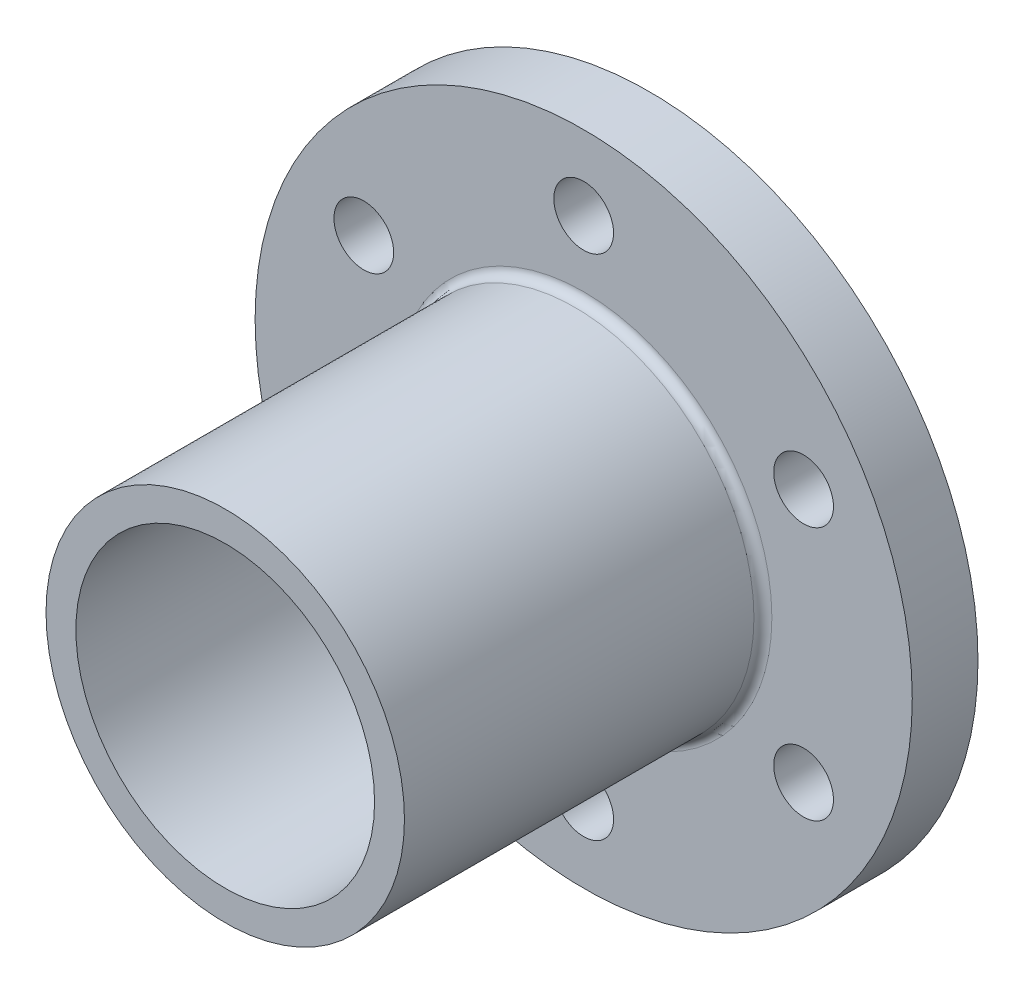
ISO-10303-21;
HEADER;
FILE_DESCRIPTION(('STEP AP214'),'2;1');
FILE_NAME('part.step','',(''),(''),'','','');
FILE_SCHEMA(('AUTOMOTIVE_DESIGN { 1 0 10303 214 1 1 1 1 }'));
ENDSEC;
DATA;
#1=APPLICATION_CONTEXT('core data for automotive mechanical design processes');
#2=APPLICATION_PROTOCOL_DEFINITION('international standard','automotive_design',2000,#1);
#3=PRODUCT_CONTEXT('',#1,'mechanical');
#4=PRODUCT('Part','Part','',(#3));
#5=PRODUCT_RELATED_PRODUCT_CATEGORY('part','',(#4));
#6=PRODUCT_DEFINITION_FORMATION('','',#4);
#7=PRODUCT_DEFINITION_CONTEXT('part definition',#1,'design');
#8=PRODUCT_DEFINITION('design','',#6,#7);
#9=PRODUCT_DEFINITION_SHAPE('','',#8);
#10=(LENGTH_UNIT() NAMED_UNIT(*) SI_UNIT(.MILLI.,.METRE.));
#11=(NAMED_UNIT(*) PLANE_ANGLE_UNIT() SI_UNIT($,.RADIAN.));
#12=(NAMED_UNIT(*) SI_UNIT($,.STERADIAN.) SOLID_ANGLE_UNIT());
#13=UNCERTAINTY_MEASURE_WITH_UNIT(LENGTH_MEASURE(1.E-05),#10,'distance_accuracy_value','');
#14=(GEOMETRIC_REPRESENTATION_CONTEXT(3) GLOBAL_UNCERTAINTY_ASSIGNED_CONTEXT((#13)) GLOBAL_UNIT_ASSIGNED_CONTEXT((#10,
#11,#12)) REPRESENTATION_CONTEXT('',''));
#15=CARTESIAN_POINT('',(0.,0.,0.));
#16=DIRECTION('',(0.,0.,1.));
#17=DIRECTION('',(1.,0.,0.));
#18=AXIS2_PLACEMENT_3D('',#15,#16,#17);
#19=CARTESIAN_POINT('',(0.,0.,22.));
#20=DIRECTION('',(0.,0.,-1.));
#21=DIRECTION('',(-1.,0.,0.));
#22=AXIS2_PLACEMENT_3D('',#19,#20,#21);
#23=CYLINDRICAL_SURFACE('',#22,110.);
#24=CARTESIAN_POINT('',(0.,0.,22.));
#25=DIRECTION('',(0.,0.,1.));
#26=DIRECTION('',(1.,0.,0.));
#27=AXIS2_PLACEMENT_3D('',#24,#25,#26);
#28=CIRCLE('',#27,110.);
#29=CARTESIAN_POINT('',(110.,0.,22.));
#30=VERTEX_POINT('',#29);
#31=EDGE_CURVE('E54',#30,#30,#28,.T.);
#32=ORIENTED_EDGE('',*,*,#31,.F.);
#33=EDGE_LOOP('',(#32));
#34=FACE_BOUND('',#33,.T.);
#35=CARTESIAN_POINT('',(0.,0.,0.));
#36=DIRECTION('',(0.,0.,1.));
#37=DIRECTION('',(1.,0.,0.));
#38=AXIS2_PLACEMENT_3D('',#35,#36,#37);
#39=CIRCLE('',#38,110.);
#40=CARTESIAN_POINT('',(110.,0.,0.));
#41=VERTEX_POINT('',#40);
#42=EDGE_CURVE('E59',#41,#41,#39,.T.);
#43=ORIENTED_EDGE('',*,*,#42,.T.);
#44=EDGE_LOOP('',(#43));
#45=FACE_BOUND('',#44,.T.);
#46=ADVANCED_FACE('F41',(#34,#45),#23,.T.);
#47=CARTESIAN_POINT('',(0.,0.,22.));
#48=DIRECTION('',(0.,0.,1.));
#49=DIRECTION('',(1.,0.,0.));
#50=AXIS2_PLACEMENT_3D('',#47,#48,#49);
#51=PLANE('',#50);
#52=CARTESIAN_POINT('',(0.,0.,22.));
#53=DIRECTION('',(0.,0.,1.));
#54=DIRECTION('',(1.,0.,0.));
#55=AXIS2_PLACEMENT_3D('',#52,#53,#54);
#56=CIRCLE('',#55,63.);
#57=CARTESIAN_POINT('',(63.,0.,22.));
#58=VERTEX_POINT('',#57);
#59=EDGE_CURVE('E10',#58,#58,#56,.F.);
#60=ORIENTED_EDGE('',*,*,#59,.T.);
#61=EDGE_LOOP('',(#60));
#62=FACE_BOUND('',#61,.T.);
#63=CARTESIAN_POINT('',(0.,85.,22.));
#64=DIRECTION('',(0.,0.,1.));
#65=DIRECTION('',(1.,0.,0.));
#66=AXIS2_PLACEMENT_3D('',#63,#64,#65);
#67=CIRCLE('',#66,10.);
#68=CARTESIAN_POINT('',(10.,85.,22.));
#69=VERTEX_POINT('',#68);
#70=EDGE_CURVE('E111',#69,#69,#67,.T.);
#71=ORIENTED_EDGE('',*,*,#70,.F.);
#72=EDGE_LOOP('',(#71));
#73=FACE_BOUND('',#72,.T.);
#74=CARTESIAN_POINT('',(-73.6121593216749,42.4999999999958,22.));
#75=DIRECTION('',(0.,0.,1.));
#76=DIRECTION('',(1.,0.,0.));
#77=AXIS2_PLACEMENT_3D('',#74,#75,#76);
#78=CIRCLE('',#77,10.0000000000045);
#79=CARTESIAN_POINT('',(-63.6121593216704,42.4999999999958,22.));
#80=VERTEX_POINT('',#79);
#81=EDGE_CURVE('E112',#80,#80,#78,.T.);
#82=ORIENTED_EDGE('',*,*,#81,.F.);
#83=EDGE_LOOP('',(#82));
#84=FACE_BOUND('',#83,.T.);
#85=CARTESIAN_POINT('',(-73.6121593216701,-42.5000000000042,22.));
#86=DIRECTION('',(0.,0.,1.));
#87=DIRECTION('',(1.,0.,0.));
#88=AXIS2_PLACEMENT_3D('',#85,#86,#87);
#89=CIRCLE('',#88,10.0000000000089);
#90=CARTESIAN_POINT('',(-63.6121593216612,-42.5000000000042,22.));
#91=VERTEX_POINT('',#90);
#92=EDGE_CURVE('E78',#91,#91,#89,.T.);
#93=ORIENTED_EDGE('',*,*,#92,.F.);
#94=EDGE_LOOP('',(#93));
#95=FACE_BOUND('',#94,.T.);
#96=CARTESIAN_POINT('',(9.63215271295911E-12,-85.,22.));
#97=DIRECTION('',(0.,0.,1.));
#98=DIRECTION('',(1.,0.,0.));
#99=AXIS2_PLACEMENT_3D('',#96,#97,#98);
#100=CIRCLE('',#99,10.0000000000098);
#101=CARTESIAN_POINT('',(10.0000000000194,-85.,22.));
#102=VERTEX_POINT('',#101);
#103=EDGE_CURVE('E87',#102,#102,#100,.T.);
#104=ORIENTED_EDGE('',*,*,#103,.F.);
#105=EDGE_LOOP('',(#104));
#106=FACE_BOUND('',#105,.T.);
#107=CARTESIAN_POINT('',(73.6121593216845,-42.4999999999958,22.));
#108=DIRECTION('',(0.,0.,1.));
#109=DIRECTION('',(1.,0.,0.));
#110=AXIS2_PLACEMENT_3D('',#107,#108,#109);
#111=CIRCLE('',#110,10.0000000000061);
#112=CARTESIAN_POINT('',(83.6121593216906,-42.4999999999958,22.));
#113=VERTEX_POINT('',#112);
#114=EDGE_CURVE('E95',#113,#113,#111,.T.);
#115=ORIENTED_EDGE('',*,*,#114,.F.);
#116=EDGE_LOOP('',(#115));
#117=FACE_BOUND('',#116,.T.);
#118=CARTESIAN_POINT('',(73.6121593216797,42.5000000000042,22.));
#119=DIRECTION('',(0.,0.,1.));
#120=DIRECTION('',(1.,0.,0.));
#121=AXIS2_PLACEMENT_3D('',#118,#119,#120);
#122=CIRCLE('',#121,10.0000000000013);
#123=CARTESIAN_POINT('',(83.612159321681,42.5000000000042,22.));
#124=VERTEX_POINT('',#123);
#125=EDGE_CURVE('E103',#124,#124,#122,.T.);
#126=ORIENTED_EDGE('',*,*,#125,.F.);
#127=EDGE_LOOP('',(#126));
#128=FACE_BOUND('',#127,.T.);
#129=ORIENTED_EDGE('',*,*,#31,.T.);
#130=EDGE_LOOP('',(#129));
#131=FACE_BOUND('',#130,.T.);
#132=ADVANCED_FACE('F136',(#62,#73,#84,#95,#106,#117,#128,#131),#51,.T.);
#133=CARTESIAN_POINT('',(0.,0.,0.));
#134=DIRECTION('',(0.,0.,1.));
#135=DIRECTION('',(1.,0.,0.));
#136=AXIS2_PLACEMENT_3D('',#133,#134,#135);
#137=PLANE('',#136);
#138=CARTESIAN_POINT('',(0.,85.,0.));
#139=DIRECTION('',(0.,0.,1.));
#140=DIRECTION('',(1.,0.,0.));
#141=AXIS2_PLACEMENT_3D('',#138,#139,#140);
#142=CIRCLE('',#141,10.);
#143=CARTESIAN_POINT('',(10.,85.,0.));
#144=VERTEX_POINT('',#143);
#145=EDGE_CURVE('E74',#144,#144,#142,.T.);
#146=ORIENTED_EDGE('',*,*,#145,.T.);
#147=EDGE_LOOP('',(#146));
#148=FACE_BOUND('',#147,.T.);
#149=CARTESIAN_POINT('',(-73.6121593216749,42.4999999999958,0.));
#150=DIRECTION('',(0.,0.,1.));
#151=DIRECTION('',(1.,0.,0.));
#152=AXIS2_PLACEMENT_3D('',#149,#150,#151);
#153=CIRCLE('',#152,10.0000000000045);
#154=CARTESIAN_POINT('',(-63.6121593216704,42.4999999999958,0.));
#155=VERTEX_POINT('',#154);
#156=EDGE_CURVE('E83',#155,#155,#153,.T.);
#157=ORIENTED_EDGE('',*,*,#156,.T.);
#158=EDGE_LOOP('',(#157));
#159=FACE_BOUND('',#158,.T.);
#160=CARTESIAN_POINT('',(-73.6121593216701,-42.5000000000042,0.));
#161=DIRECTION('',(0.,0.,1.));
#162=DIRECTION('',(1.,0.,0.));
#163=AXIS2_PLACEMENT_3D('',#160,#161,#162);
#164=CIRCLE('',#163,10.0000000000089);
#165=CARTESIAN_POINT('',(-63.6121593216612,-42.5000000000042,0.));
#166=VERTEX_POINT('',#165);
#167=EDGE_CURVE('E82',#166,#166,#164,.T.);
#168=ORIENTED_EDGE('',*,*,#167,.T.);
#169=EDGE_LOOP('',(#168));
#170=FACE_BOUND('',#169,.T.);
#171=CARTESIAN_POINT('',(9.63215271295911E-12,-85.,0.));
#172=DIRECTION('',(0.,0.,1.));
#173=DIRECTION('',(1.,0.,0.));
#174=AXIS2_PLACEMENT_3D('',#171,#172,#173);
#175=CIRCLE('',#174,10.0000000000098);
#176=CARTESIAN_POINT('',(10.0000000000194,-85.,0.));
#177=VERTEX_POINT('',#176);
#178=EDGE_CURVE('E91',#177,#177,#175,.T.);
#179=ORIENTED_EDGE('',*,*,#178,.T.);
#180=EDGE_LOOP('',(#179));
#181=FACE_BOUND('',#180,.T.);
#182=CARTESIAN_POINT('',(73.6121593216845,-42.4999999999958,0.));
#183=DIRECTION('',(0.,0.,1.));
#184=DIRECTION('',(1.,0.,0.));
#185=AXIS2_PLACEMENT_3D('',#182,#183,#184);
#186=CIRCLE('',#185,10.0000000000061);
#187=CARTESIAN_POINT('',(83.6121593216906,-42.4999999999958,0.));
#188=VERTEX_POINT('',#187);
#189=EDGE_CURVE('E99',#188,#188,#186,.T.);
#190=ORIENTED_EDGE('',*,*,#189,.T.);
#191=EDGE_LOOP('',(#190));
#192=FACE_BOUND('',#191,.T.);
#193=CARTESIAN_POINT('',(73.6121593216797,42.5000000000042,0.));
#194=DIRECTION('',(0.,0.,1.));
#195=DIRECTION('',(1.,0.,0.));
#196=AXIS2_PLACEMENT_3D('',#193,#194,#195);
#197=CIRCLE('',#196,10.0000000000013);
#198=CARTESIAN_POINT('',(83.612159321681,42.5000000000042,0.));
#199=VERTEX_POINT('',#198);
#200=EDGE_CURVE('E107',#199,#199,#197,.T.);
#201=ORIENTED_EDGE('',*,*,#200,.T.);
#202=EDGE_LOOP('',(#201));
#203=FACE_BOUND('',#202,.T.);
#204=CARTESIAN_POINT('',(0.,0.,0.));
#205=DIRECTION('',(0.,0.,1.));
#206=DIRECTION('',(1.,0.,0.));
#207=AXIS2_PLACEMENT_3D('',#204,#205,#206);
#208=CIRCLE('',#207,50.);
#209=CARTESIAN_POINT('',(50.,0.,0.));
#210=VERTEX_POINT('',#209);
#211=EDGE_CURVE('E69',#210,#210,#208,.T.);
#212=ORIENTED_EDGE('',*,*,#211,.T.);
#213=EDGE_LOOP('',(#212));
#214=FACE_BOUND('',#213,.T.);
#215=ORIENTED_EDGE('',*,*,#42,.F.);
#216=EDGE_LOOP('',(#215));
#217=FACE_BOUND('',#216,.T.);
#218=ADVANCED_FACE('F126',(#148,#159,#170,#181,#192,#203,#214,#217),#137,.F.);
#219=CARTESIAN_POINT('',(0.,0.,142.));
#220=DIRECTION('',(0.,0.,-1.));
#221=DIRECTION('',(-1.,0.,0.));
#222=AXIS2_PLACEMENT_3D('',#219,#220,#221);
#223=CYLINDRICAL_SURFACE('',#222,60.);
#224=CARTESIAN_POINT('',(0.,0.,25.));
#225=DIRECTION('',(0.,0.,1.));
#226=DIRECTION('',(1.,0.,0.));
#227=AXIS2_PLACEMENT_3D('',#224,#225,#226);
#228=CIRCLE('',#227,60.);
#229=CARTESIAN_POINT('',(60.,0.,25.));
#230=VERTEX_POINT('',#229);
#231=EDGE_CURVE('E49',#230,#230,#228,.T.);
#232=ORIENTED_EDGE('',*,*,#231,.T.);
#233=EDGE_LOOP('',(#232));
#234=FACE_BOUND('',#233,.T.);
#235=CARTESIAN_POINT('',(0.,0.,142.));
#236=DIRECTION('',(0.,0.,1.));
#237=DIRECTION('',(1.,0.,0.));
#238=AXIS2_PLACEMENT_3D('',#235,#236,#237);
#239=CIRCLE('',#238,60.);
#240=CARTESIAN_POINT('',(60.,0.,142.));
#241=VERTEX_POINT('',#240);
#242=EDGE_CURVE('E64',#241,#241,#239,.T.);
#243=ORIENTED_EDGE('',*,*,#242,.F.);
#244=EDGE_LOOP('',(#243));
#245=FACE_BOUND('',#244,.T.);
#246=ADVANCED_FACE('F157',(#234,#245),#223,.T.);
#247=CARTESIAN_POINT('',(0.,0.,142.));
#248=DIRECTION('',(0.,0.,1.));
#249=DIRECTION('',(1.,0.,0.));
#250=AXIS2_PLACEMENT_3D('',#247,#248,#249);
#251=PLANE('',#250);
#252=CARTESIAN_POINT('',(0.,0.,142.));
#253=DIRECTION('',(0.,0.,1.));
#254=DIRECTION('',(1.,0.,0.));
#255=AXIS2_PLACEMENT_3D('',#252,#253,#254);
#256=CIRCLE('',#255,50.);
#257=CARTESIAN_POINT('',(50.,0.,142.));
#258=VERTEX_POINT('',#257);
#259=EDGE_CURVE('E70',#258,#258,#256,.T.);
#260=ORIENTED_EDGE('',*,*,#259,.F.);
#261=EDGE_LOOP('',(#260));
#262=FACE_BOUND('',#261,.T.);
#263=ORIENTED_EDGE('',*,*,#242,.T.);
#264=EDGE_LOOP('',(#263));
#265=FACE_BOUND('',#264,.T.);
#266=ADVANCED_FACE('F162',(#262,#265),#251,.T.);
#267=CARTESIAN_POINT('',(0.,0.,0.));
#268=DIRECTION('',(0.,0.,1.));
#269=DIRECTION('',(1.,0.,0.));
#270=AXIS2_PLACEMENT_3D('',#267,#268,#269);
#271=CYLINDRICAL_SURFACE('',#270,50.);
#272=ORIENTED_EDGE('',*,*,#211,.F.);
#273=EDGE_LOOP('',(#272));
#274=FACE_BOUND('',#273,.T.);
#275=ORIENTED_EDGE('',*,*,#259,.T.);
#276=EDGE_LOOP('',(#275));
#277=FACE_BOUND('',#276,.T.);
#278=ADVANCED_FACE('F167',(#274,#277),#271,.F.);
#279=CARTESIAN_POINT('',(73.6121593216797,42.5000000000042,0.));
#280=DIRECTION('',(0.,0.,1.));
#281=DIRECTION('',(1.,0.,0.));
#282=AXIS2_PLACEMENT_3D('',#279,#280,#281);
#283=CYLINDRICAL_SURFACE('',#282,10.0000000000013);
#284=ORIENTED_EDGE('',*,*,#200,.F.);
#285=EDGE_LOOP('',(#284));
#286=FACE_BOUND('',#285,.T.);
#287=ORIENTED_EDGE('',*,*,#125,.T.);
#288=EDGE_LOOP('',(#287));
#289=FACE_BOUND('',#288,.T.);
#290=ADVANCED_FACE('F171',(#286,#289),#283,.F.);
#291=CARTESIAN_POINT('',(73.6121593216845,-42.4999999999958,0.));
#292=DIRECTION('',(0.,0.,1.));
#293=DIRECTION('',(1.,0.,0.));
#294=AXIS2_PLACEMENT_3D('',#291,#292,#293);
#295=CYLINDRICAL_SURFACE('',#294,10.0000000000061);
#296=ORIENTED_EDGE('',*,*,#189,.F.);
#297=EDGE_LOOP('',(#296));
#298=FACE_BOUND('',#297,.T.);
#299=ORIENTED_EDGE('',*,*,#114,.T.);
#300=EDGE_LOOP('',(#299));
#301=FACE_BOUND('',#300,.T.);
#302=ADVANCED_FACE('F180',(#298,#301),#295,.F.);
#303=CARTESIAN_POINT('',(9.63215271295911E-12,-85.,0.));
#304=DIRECTION('',(0.,0.,1.));
#305=DIRECTION('',(1.,0.,0.));
#306=AXIS2_PLACEMENT_3D('',#303,#304,#305);
#307=CYLINDRICAL_SURFACE('',#306,10.0000000000098);
#308=ORIENTED_EDGE('',*,*,#178,.F.);
#309=EDGE_LOOP('',(#308));
#310=FACE_BOUND('',#309,.T.);
#311=ORIENTED_EDGE('',*,*,#103,.T.);
#312=EDGE_LOOP('',(#311));
#313=FACE_BOUND('',#312,.T.);
#314=ADVANCED_FACE('F176',(#310,#313),#307,.F.);
#315=CARTESIAN_POINT('',(-73.6121593216701,-42.5000000000042,0.));
#316=DIRECTION('',(0.,0.,1.));
#317=DIRECTION('',(1.,0.,0.));
#318=AXIS2_PLACEMENT_3D('',#315,#316,#317);
#319=CYLINDRICAL_SURFACE('',#318,10.0000000000089);
#320=ORIENTED_EDGE('',*,*,#167,.F.);
#321=EDGE_LOOP('',(#320));
#322=FACE_BOUND('',#321,.T.);
#323=ORIENTED_EDGE('',*,*,#92,.T.);
#324=EDGE_LOOP('',(#323));
#325=FACE_BOUND('',#324,.T.);
#326=ADVANCED_FACE('F173',(#322,#325),#319,.F.);
#327=CARTESIAN_POINT('',(-73.6121593216749,42.4999999999958,0.));
#328=DIRECTION('',(0.,0.,1.));
#329=DIRECTION('',(1.,0.,0.));
#330=AXIS2_PLACEMENT_3D('',#327,#328,#329);
#331=CYLINDRICAL_SURFACE('',#330,10.0000000000045);
#332=ORIENTED_EDGE('',*,*,#156,.F.);
#333=EDGE_LOOP('',(#332));
#334=FACE_BOUND('',#333,.T.);
#335=ORIENTED_EDGE('',*,*,#81,.T.);
#336=EDGE_LOOP('',(#335));
#337=FACE_BOUND('',#336,.T.);
#338=ADVANCED_FACE('F132',(#334,#337),#331,.F.);
#339=CARTESIAN_POINT('',(0.,85.,0.));
#340=DIRECTION('',(0.,0.,1.));
#341=DIRECTION('',(1.,0.,0.));
#342=AXIS2_PLACEMENT_3D('',#339,#340,#341);
#343=CYLINDRICAL_SURFACE('',#342,10.);
#344=ORIENTED_EDGE('',*,*,#145,.F.);
#345=EDGE_LOOP('',(#344));
#346=FACE_BOUND('',#345,.T.);
#347=ORIENTED_EDGE('',*,*,#70,.T.);
#348=EDGE_LOOP('',(#347));
#349=FACE_BOUND('',#348,.T.);
#350=ADVANCED_FACE('F129',(#346,#349),#343,.F.);
#351=CARTESIAN_POINT('',(0.,0.,25.));
#352=DIRECTION('',(0.,0.,1.));
#353=DIRECTION('',(1.,0.,0.));
#354=AXIS2_PLACEMENT_3D('',#351,#352,#353);
#355=TOROIDAL_SURFACE('',#354,63.,3.);
#356=ORIENTED_EDGE('',*,*,#59,.F.);
#357=EDGE_LOOP('',(#356));
#358=FACE_BOUND('',#357,.T.);
#359=ORIENTED_EDGE('',*,*,#231,.F.);
#360=EDGE_LOOP('',(#359));
#361=FACE_BOUND('',#360,.T.);
#362=ADVANCED_FACE('F43',(#358,#361),#355,.F.);
#363=CLOSED_SHELL('',(#46,#132,#218,#246,#266,#278,#290,#302,#314,#326,#338,#350,#362));
#364=MANIFOLD_SOLID_BREP('B2',#363);
#365=ADVANCED_BREP_SHAPE_REPRESENTATION('',(#18,#364),#14);
#366=SHAPE_DEFINITION_REPRESENTATION(#9,#365);
ENDSEC;
END-ISO-10303-21;
